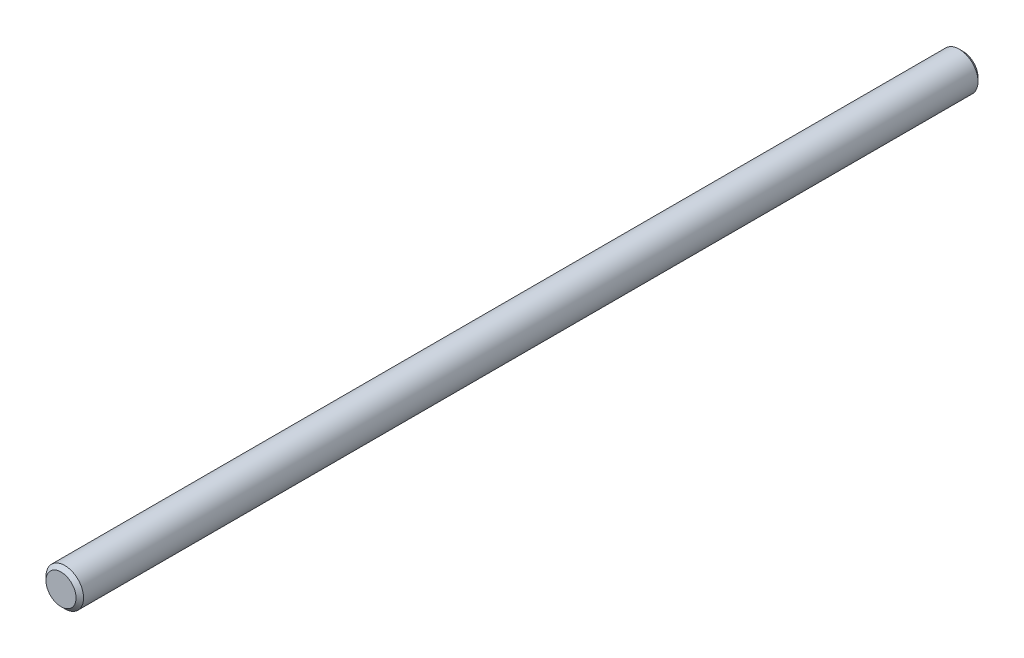
ISO-10303-21;
HEADER;
FILE_DESCRIPTION(('STEP AP214'),'2;1');
FILE_NAME('part.step','',(''),(''),'','','');
FILE_SCHEMA(('AUTOMOTIVE_DESIGN { 1 0 10303 214 1 1 1 1 }'));
ENDSEC;
DATA;
#1=APPLICATION_CONTEXT('core data for automotive mechanical design processes');
#2=APPLICATION_PROTOCOL_DEFINITION('international standard','automotive_design',2000,#1);
#3=PRODUCT_CONTEXT('',#1,'mechanical');
#4=PRODUCT('Part','Part','',(#3));
#5=PRODUCT_RELATED_PRODUCT_CATEGORY('part','',(#4));
#6=PRODUCT_DEFINITION_FORMATION('','',#4);
#7=PRODUCT_DEFINITION_CONTEXT('part definition',#1,'design');
#8=PRODUCT_DEFINITION('design','',#6,#7);
#9=PRODUCT_DEFINITION_SHAPE('','',#8);
#10=(LENGTH_UNIT() NAMED_UNIT(*) SI_UNIT(.MILLI.,.METRE.));
#11=(NAMED_UNIT(*) PLANE_ANGLE_UNIT() SI_UNIT($,.RADIAN.));
#12=(NAMED_UNIT(*) SI_UNIT($,.STERADIAN.) SOLID_ANGLE_UNIT());
#13=UNCERTAINTY_MEASURE_WITH_UNIT(LENGTH_MEASURE(1.E-05),#10,'distance_accuracy_value','');
#14=(GEOMETRIC_REPRESENTATION_CONTEXT(3) GLOBAL_UNCERTAINTY_ASSIGNED_CONTEXT((#13)) GLOBAL_UNIT_ASSIGNED_CONTEXT((#10,
#11,#12)) REPRESENTATION_CONTEXT('',''));
#15=CARTESIAN_POINT('',(0.,0.,0.));
#16=DIRECTION('',(0.,0.,1.));
#17=DIRECTION('',(1.,0.,0.));
#18=AXIS2_PLACEMENT_3D('',#15,#16,#17);
#19=CARTESIAN_POINT('',(0.,0.,76.2));
#20=DIRECTION('',(0.,0.,-1.));
#21=DIRECTION('',(-1.,0.,0.));
#22=AXIS2_PLACEMENT_3D('',#19,#20,#21);
#23=CYLINDRICAL_SURFACE('',#22,3.175);
#24=CARTESIAN_POINT('',(0.,0.,-75.5649999999999));
#25=DIRECTION('',(0.,0.,1.));
#26=DIRECTION('',(1.,0.,0.));
#27=AXIS2_PLACEMENT_3D('',#24,#25,#26);
#28=CIRCLE('',#27,3.175);
#29=CARTESIAN_POINT('',(3.175,0.,-75.5649999999999));
#30=VERTEX_POINT('',#29);
#31=EDGE_CURVE('E50',#30,#30,#28,.T.);
#32=ORIENTED_EDGE('',*,*,#31,.T.);
#33=EDGE_LOOP('',(#32));
#34=FACE_BOUND('',#33,.T.);
#35=CARTESIAN_POINT('',(0.,0.,75.5650000000001));
#36=DIRECTION('',(0.,0.,1.));
#37=DIRECTION('',(1.,0.,0.));
#38=AXIS2_PLACEMENT_3D('',#35,#36,#37);
#39=CIRCLE('',#38,3.175);
#40=CARTESIAN_POINT('',(3.175,0.,75.5650000000001));
#41=VERTEX_POINT('',#40);
#42=EDGE_CURVE('E54',#41,#41,#39,.F.);
#43=ORIENTED_EDGE('',*,*,#42,.T.);
#44=EDGE_LOOP('',(#43));
#45=FACE_BOUND('',#44,.T.);
#46=ADVANCED_FACE('F39',(#34,#45),#23,.T.);
#47=CARTESIAN_POINT('',(0.,0.,76.2));
#48=DIRECTION('',(0.,0.,1.));
#49=DIRECTION('',(1.,0.,0.));
#50=AXIS2_PLACEMENT_3D('',#47,#48,#49);
#51=PLANE('',#50);
#52=CARTESIAN_POINT('',(0.,0.,76.2));
#53=DIRECTION('',(0.,0.,1.));
#54=DIRECTION('',(1.,0.,0.));
#55=AXIS2_PLACEMENT_3D('',#52,#53,#54);
#56=CIRCLE('',#55,2.54000000000008);
#57=CARTESIAN_POINT('',(2.54000000000008,0.,76.2));
#58=VERTEX_POINT('',#57);
#59=EDGE_CURVE('E10',#58,#58,#56,.T.);
#60=ORIENTED_EDGE('',*,*,#59,.T.);
#61=EDGE_LOOP('',(#60));
#62=FACE_BOUND('',#61,.T.);
#63=ADVANCED_FACE('F70',(#62),#51,.T.);
#64=CARTESIAN_POINT('',(0.,0.,-76.2));
#65=DIRECTION('',(0.,0.,1.));
#66=DIRECTION('',(1.,0.,0.));
#67=AXIS2_PLACEMENT_3D('',#64,#65,#66);
#68=PLANE('',#67);
#69=CARTESIAN_POINT('',(0.,0.,-76.2));
#70=DIRECTION('',(0.,0.,1.));
#71=DIRECTION('',(1.,0.,0.));
#72=AXIS2_PLACEMENT_3D('',#69,#70,#71);
#73=CIRCLE('',#72,2.53999999999988);
#74=CARTESIAN_POINT('',(2.53999999999988,0.,-76.2));
#75=VERTEX_POINT('',#74);
#76=EDGE_CURVE('E46',#75,#75,#73,.F.);
#77=ORIENTED_EDGE('',*,*,#76,.T.);
#78=EDGE_LOOP('',(#77));
#79=FACE_BOUND('',#78,.T.);
#80=ADVANCED_FACE('F67',(#79),#68,.F.);
#81=CARTESIAN_POINT('',(0.,0.,-75.5649999999999));
#82=DIRECTION('',(0.,0.,1.));
#83=DIRECTION('',(1.,0.,0.));
#84=AXIS2_PLACEMENT_3D('',#81,#82,#83);
#85=CONICAL_SURFACE('',#84,3.175,0.78539816339744);
#86=ORIENTED_EDGE('',*,*,#76,.F.);
#87=EDGE_LOOP('',(#86));
#88=FACE_BOUND('',#87,.T.);
#89=ORIENTED_EDGE('',*,*,#31,.F.);
#90=EDGE_LOOP('',(#89));
#91=FACE_BOUND('',#90,.T.);
#92=ADVANCED_FACE('F63',(#88,#91),#85,.T.);
#93=CARTESIAN_POINT('',(0.,0.,76.2));
#94=DIRECTION('',(0.,0.,-1.));
#95=DIRECTION('',(-1.,0.,0.));
#96=AXIS2_PLACEMENT_3D('',#93,#94,#95);
#97=CONICAL_SURFACE('',#96,2.54000000000008,0.785398163397451);
#98=ORIENTED_EDGE('',*,*,#42,.F.);
#99=EDGE_LOOP('',(#98));
#100=FACE_BOUND('',#99,.T.);
#101=ORIENTED_EDGE('',*,*,#59,.F.);
#102=EDGE_LOOP('',(#101));
#103=FACE_BOUND('',#102,.T.);
#104=ADVANCED_FACE('F41',(#100,#103),#97,.T.);
#105=CLOSED_SHELL('',(#46,#63,#80,#92,#104));
#106=MANIFOLD_SOLID_BREP('B2',#105);
#107=ADVANCED_BREP_SHAPE_REPRESENTATION('',(#18,#106),#14);
#108=SHAPE_DEFINITION_REPRESENTATION(#9,#107);
ENDSEC;
END-ISO-10303-21;
